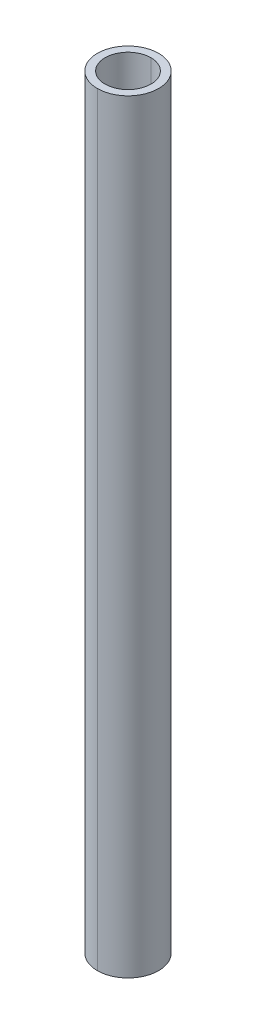
ISO-10303-21;
HEADER;
FILE_DESCRIPTION(('STEP AP214'),'2;1');
FILE_NAME('part.step','',(''),(''),'','','');
FILE_SCHEMA(('AUTOMOTIVE_DESIGN { 1 0 10303 214 1 1 1 1 }'));
ENDSEC;
DATA;
#1=APPLICATION_CONTEXT('core data for automotive mechanical design processes');
#2=APPLICATION_PROTOCOL_DEFINITION('international standard','automotive_design',2000,#1);
#3=PRODUCT_CONTEXT('',#1,'mechanical');
#4=PRODUCT('Part','Part','',(#3));
#5=PRODUCT_RELATED_PRODUCT_CATEGORY('part','',(#4));
#6=PRODUCT_DEFINITION_FORMATION('','',#4);
#7=PRODUCT_DEFINITION_CONTEXT('part definition',#1,'design');
#8=PRODUCT_DEFINITION('design','',#6,#7);
#9=PRODUCT_DEFINITION_SHAPE('','',#8);
#10=(LENGTH_UNIT() NAMED_UNIT(*) SI_UNIT(.MILLI.,.METRE.));
#11=(NAMED_UNIT(*) PLANE_ANGLE_UNIT() SI_UNIT($,.RADIAN.));
#12=(NAMED_UNIT(*) SI_UNIT($,.STERADIAN.) SOLID_ANGLE_UNIT());
#13=UNCERTAINTY_MEASURE_WITH_UNIT(LENGTH_MEASURE(1.E-05),#10,'distance_accuracy_value','');
#14=(GEOMETRIC_REPRESENTATION_CONTEXT(3) GLOBAL_UNCERTAINTY_ASSIGNED_CONTEXT((#13)) GLOBAL_UNIT_ASSIGNED_CONTEXT((#10,
#11,#12)) REPRESENTATION_CONTEXT('',''));
#15=CARTESIAN_POINT('',(0.,0.,0.));
#16=DIRECTION('',(0.,0.,1.));
#17=DIRECTION('',(1.,0.,0.));
#18=AXIS2_PLACEMENT_3D('',#15,#16,#17);
#19=CARTESIAN_POINT('',(0.,100.,0.));
#20=DIRECTION('',(0.,-1.,0.));
#21=DIRECTION('',(0.,0.,-1.));
#22=AXIS2_PLACEMENT_3D('',#19,#20,#21);
#23=CYLINDRICAL_SURFACE('',#22,3.);
#24=DIRECTION('',(0.,-1.,0.));
#25=VECTOR('',#24,1.);
#26=CARTESIAN_POINT('',(0.,100.,3.));
#27=LINE('',#26,#25);
#28=CARTESIAN_POINT('',(0.,100.,3.));
#29=VERTEX_POINT('',#28);
#30=CARTESIAN_POINT('',(0.,0.,3.));
#31=VERTEX_POINT('',#30);
#32=EDGE_CURVE('E80',#29,#31,#27,.T.);
#33=ORIENTED_EDGE('',*,*,#32,.F.);
#34=CARTESIAN_POINT('',(0.,100.,0.));
#35=DIRECTION('',(0.,1.,0.));
#36=DIRECTION('',(0.,0.,1.));
#37=AXIS2_PLACEMENT_3D('',#34,#35,#36);
#38=CIRCLE('',#37,3.);
#39=CARTESIAN_POINT('',(0.,100.,-3.));
#40=VERTEX_POINT('',#39);
#41=EDGE_CURVE('E71',#29,#40,#38,.T.);
#42=ORIENTED_EDGE('',*,*,#41,.T.);
#43=DIRECTION('',(0.,-1.,0.));
#44=VECTOR('',#43,1.);
#45=CARTESIAN_POINT('',(0.,100.,-3.));
#46=LINE('',#45,#44);
#47=CARTESIAN_POINT('',(0.,0.,-3.));
#48=VERTEX_POINT('',#47);
#49=EDGE_CURVE('E18',#40,#48,#46,.T.);
#50=ORIENTED_EDGE('',*,*,#49,.T.);
#51=CARTESIAN_POINT('',(0.,0.,0.));
#52=DIRECTION('',(0.,1.,0.));
#53=DIRECTION('',(0.,0.,1.));
#54=AXIS2_PLACEMENT_3D('',#51,#52,#53);
#55=CIRCLE('',#54,3.);
#56=EDGE_CURVE('E9',#31,#48,#55,.T.);
#57=ORIENTED_EDGE('',*,*,#56,.F.);
#58=EDGE_LOOP('',(#33,#42,#50,#57));
#59=FACE_BOUND('',#58,.T.);
#60=ADVANCED_FACE('F14',(#59),#23,.F.);
#61=CARTESIAN_POINT('',(0.,100.,0.));
#62=DIRECTION('',(0.,-1.,0.));
#63=DIRECTION('',(0.,0.,-1.));
#64=AXIS2_PLACEMENT_3D('',#61,#62,#63);
#65=CYLINDRICAL_SURFACE('',#64,4.);
#66=DIRECTION('',(0.,-1.,0.));
#67=VECTOR('',#66,1.);
#68=CARTESIAN_POINT('',(0.,100.,4.));
#69=LINE('',#68,#67);
#70=CARTESIAN_POINT('',(0.,100.,4.));
#71=VERTEX_POINT('',#70);
#72=CARTESIAN_POINT('',(0.,0.,4.));
#73=VERTEX_POINT('',#72);
#74=EDGE_CURVE('E100',#71,#73,#69,.T.);
#75=ORIENTED_EDGE('',*,*,#74,.F.);
#76=CARTESIAN_POINT('',(0.,100.,0.));
#77=DIRECTION('',(0.,1.,0.));
#78=DIRECTION('',(0.,0.,1.));
#79=AXIS2_PLACEMENT_3D('',#76,#77,#78);
#80=CIRCLE('',#79,4.);
#81=CARTESIAN_POINT('',(0.,100.,-4.));
#82=VERTEX_POINT('',#81);
#83=EDGE_CURVE('E77',#82,#71,#80,.T.);
#84=ORIENTED_EDGE('',*,*,#83,.F.);
#85=DIRECTION('',(0.,-1.,0.));
#86=VECTOR('',#85,1.);
#87=CARTESIAN_POINT('',(0.,100.,-4.));
#88=LINE('',#87,#86);
#89=CARTESIAN_POINT('',(0.,0.,-4.));
#90=VERTEX_POINT('',#89);
#91=EDGE_CURVE('E94',#82,#90,#88,.T.);
#92=ORIENTED_EDGE('',*,*,#91,.T.);
#93=CARTESIAN_POINT('',(0.,0.,0.));
#94=DIRECTION('',(0.,1.,0.));
#95=DIRECTION('',(0.,0.,1.));
#96=AXIS2_PLACEMENT_3D('',#93,#94,#95);
#97=CIRCLE('',#96,4.);
#98=EDGE_CURVE('E25',#90,#73,#97,.T.);
#99=ORIENTED_EDGE('',*,*,#98,.T.);
#100=EDGE_LOOP('',(#75,#84,#92,#99));
#101=FACE_BOUND('',#100,.T.);
#102=ADVANCED_FACE('F118',(#101),#65,.T.);
#103=CARTESIAN_POINT('',(0.,0.,0.));
#104=DIRECTION('',(0.,1.,0.));
#105=DIRECTION('',(1.,0.,0.));
#106=AXIS2_PLACEMENT_3D('',#103,#104,#105);
#107=PLANE('',#106);
#108=CARTESIAN_POINT('',(0.,0.,0.));
#109=DIRECTION('',(0.,1.,0.));
#110=DIRECTION('',(0.,0.,1.));
#111=AXIS2_PLACEMENT_3D('',#108,#109,#110);
#112=CIRCLE('',#111,3.);
#113=EDGE_CURVE('E84',#48,#31,#112,.T.);
#114=ORIENTED_EDGE('',*,*,#113,.T.);
#115=ORIENTED_EDGE('',*,*,#56,.T.);
#116=EDGE_LOOP('',(#114,#115));
#117=FACE_BOUND('',#116,.T.);
#118=ORIENTED_EDGE('',*,*,#98,.F.);
#119=CARTESIAN_POINT('',(0.,0.,0.));
#120=DIRECTION('',(0.,1.,0.));
#121=DIRECTION('',(0.,0.,1.));
#122=AXIS2_PLACEMENT_3D('',#119,#120,#121);
#123=CIRCLE('',#122,4.);
#124=EDGE_CURVE('E96',#73,#90,#123,.T.);
#125=ORIENTED_EDGE('',*,*,#124,.F.);
#126=EDGE_LOOP('',(#118,#125));
#127=FACE_BOUND('',#126,.T.);
#128=ADVANCED_FACE('F116',(#117,#127),#107,.F.);
#129=CARTESIAN_POINT('',(0.,100.,0.));
#130=DIRECTION('',(0.,1.,0.));
#131=DIRECTION('',(1.,0.,0.));
#132=AXIS2_PLACEMENT_3D('',#129,#130,#131);
#133=PLANE('',#132);
#134=CARTESIAN_POINT('',(0.,100.,0.));
#135=DIRECTION('',(0.,1.,0.));
#136=DIRECTION('',(0.,0.,1.));
#137=AXIS2_PLACEMENT_3D('',#134,#135,#136);
#138=CIRCLE('',#137,3.);
#139=EDGE_CURVE('E74',#40,#29,#138,.T.);
#140=ORIENTED_EDGE('',*,*,#139,.F.);
#141=ORIENTED_EDGE('',*,*,#41,.F.);
#142=EDGE_LOOP('',(#140,#141));
#143=FACE_BOUND('',#142,.T.);
#144=ORIENTED_EDGE('',*,*,#83,.T.);
#145=CARTESIAN_POINT('',(0.,100.,0.));
#146=DIRECTION('',(0.,1.,0.));
#147=DIRECTION('',(0.,0.,1.));
#148=AXIS2_PLACEMENT_3D('',#145,#146,#147);
#149=CIRCLE('',#148,4.);
#150=EDGE_CURVE('E102',#71,#82,#149,.T.);
#151=ORIENTED_EDGE('',*,*,#150,.T.);
#152=EDGE_LOOP('',(#144,#151));
#153=FACE_BOUND('',#152,.T.);
#154=ADVANCED_FACE('F16',(#143,#153),#133,.T.);
#155=CARTESIAN_POINT('',(0.,100.,0.));
#156=DIRECTION('',(0.,-1.,0.));
#157=DIRECTION('',(0.,0.,-1.));
#158=AXIS2_PLACEMENT_3D('',#155,#156,#157);
#159=CYLINDRICAL_SURFACE('',#158,4.);
#160=ORIENTED_EDGE('',*,*,#150,.F.);
#161=ORIENTED_EDGE('',*,*,#74,.T.);
#162=ORIENTED_EDGE('',*,*,#124,.T.);
#163=ORIENTED_EDGE('',*,*,#91,.F.);
#164=EDGE_LOOP('',(#160,#161,#162,#163));
#165=FACE_BOUND('',#164,.T.);
#166=ADVANCED_FACE('F125',(#165),#159,.T.);
#167=CARTESIAN_POINT('',(0.,100.,0.));
#168=DIRECTION('',(0.,-1.,0.));
#169=DIRECTION('',(0.,0.,-1.));
#170=AXIS2_PLACEMENT_3D('',#167,#168,#169);
#171=CYLINDRICAL_SURFACE('',#170,3.);
#172=ORIENTED_EDGE('',*,*,#139,.T.);
#173=ORIENTED_EDGE('',*,*,#32,.T.);
#174=ORIENTED_EDGE('',*,*,#113,.F.);
#175=ORIENTED_EDGE('',*,*,#49,.F.);
#176=EDGE_LOOP('',(#172,#173,#174,#175));
#177=FACE_BOUND('',#176,.T.);
#178=ADVANCED_FACE('F86',(#177),#171,.F.);
#179=CLOSED_SHELL('',(#60,#102,#128,#154,#166,#178));
#180=MANIFOLD_SOLID_BREP('B1',#179);
#181=ADVANCED_BREP_SHAPE_REPRESENTATION('',(#18,#180),#14);
#182=SHAPE_DEFINITION_REPRESENTATION(#9,#181);
ENDSEC;
END-ISO-10303-21;
